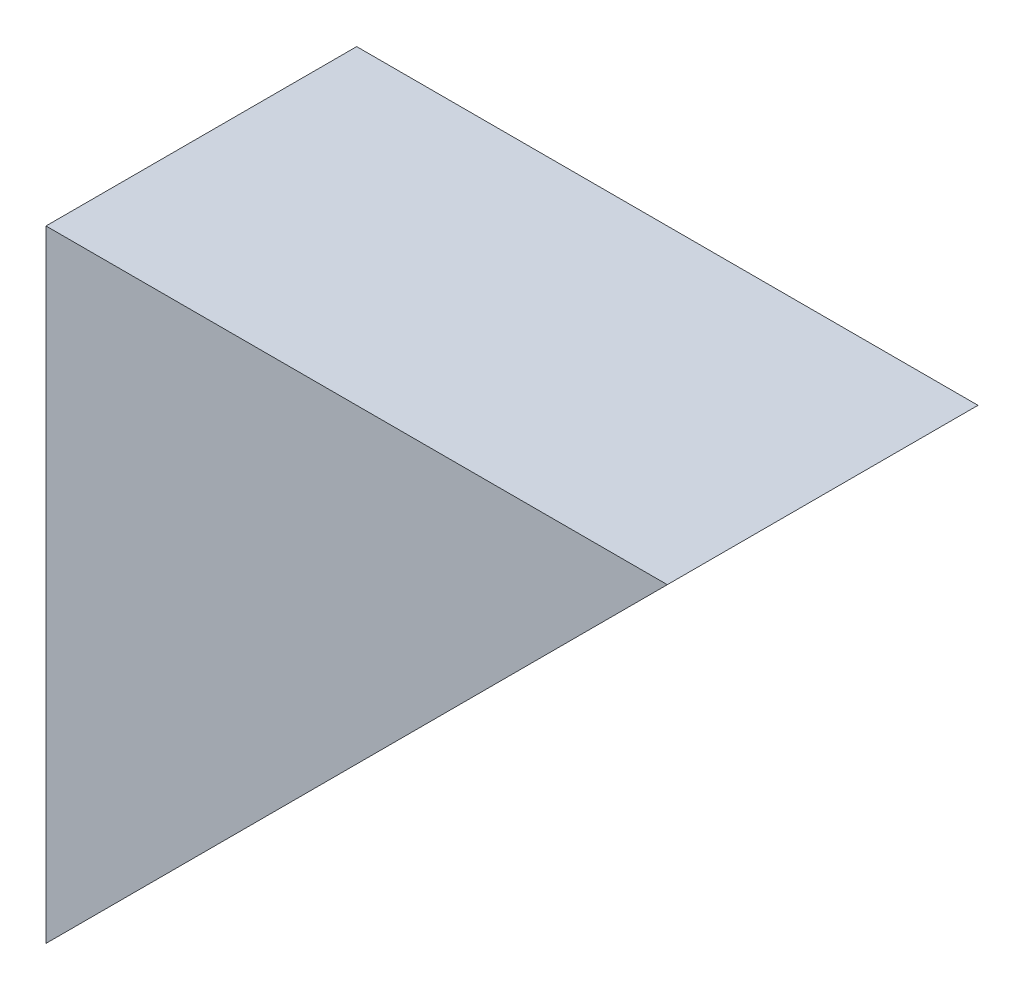
ISO-10303-21;
HEADER;
FILE_DESCRIPTION(('STEP AP214'),'2;1');
FILE_NAME('part.step','',(''),(''),'','','');
FILE_SCHEMA(('AUTOMOTIVE_DESIGN { 1 0 10303 214 1 1 1 1 }'));
ENDSEC;
DATA;
#1=APPLICATION_CONTEXT('core data for automotive mechanical design processes');
#2=APPLICATION_PROTOCOL_DEFINITION('international standard','automotive_design',2000,#1);
#3=PRODUCT_CONTEXT('',#1,'mechanical');
#4=PRODUCT('Part','Part','',(#3));
#5=PRODUCT_RELATED_PRODUCT_CATEGORY('part','',(#4));
#6=PRODUCT_DEFINITION_FORMATION('','',#4);
#7=PRODUCT_DEFINITION_CONTEXT('part definition',#1,'design');
#8=PRODUCT_DEFINITION('design','',#6,#7);
#9=PRODUCT_DEFINITION_SHAPE('','',#8);
#10=(LENGTH_UNIT() NAMED_UNIT(*) SI_UNIT(.MILLI.,.METRE.));
#11=(NAMED_UNIT(*) PLANE_ANGLE_UNIT() SI_UNIT($,.RADIAN.));
#12=(NAMED_UNIT(*) SI_UNIT($,.STERADIAN.) SOLID_ANGLE_UNIT());
#13=UNCERTAINTY_MEASURE_WITH_UNIT(LENGTH_MEASURE(1.E-05),#10,'distance_accuracy_value','');
#14=(GEOMETRIC_REPRESENTATION_CONTEXT(3) GLOBAL_UNCERTAINTY_ASSIGNED_CONTEXT((#13)) GLOBAL_UNIT_ASSIGNED_CONTEXT((#10,
#11,#12)) REPRESENTATION_CONTEXT('',''));
#15=CARTESIAN_POINT('',(0.,0.,0.));
#16=DIRECTION('',(0.,0.,1.));
#17=DIRECTION('',(1.,0.,0.));
#18=AXIS2_PLACEMENT_3D('',#15,#16,#17);
#19=CARTESIAN_POINT('',(-108.204482014186,92.0763617510564,-12.7));
#20=DIRECTION('',(0.,1.,0.));
#21=DIRECTION('',(0.,0.,1.));
#22=AXIS2_PLACEMENT_3D('',#19,#20,#21);
#23=PLANE('',#22);
#24=DIRECTION('',(-1.,0.,0.));
#25=VECTOR('',#24,1.);
#26=CARTESIAN_POINT('',(-108.204482014186,92.0763617510564,0.));
#27=LINE('',#26,#25);
#28=CARTESIAN_POINT('',(-82.8044820141863,92.0763617510564,0.));
#29=VERTEX_POINT('',#28);
#30=CARTESIAN_POINT('',(-108.204482014186,92.0763617510564,0.));
#31=VERTEX_POINT('',#30);
#32=EDGE_CURVE('E120',#29,#31,#27,.T.);
#33=ORIENTED_EDGE('',*,*,#32,.F.);
#34=DIRECTION('',(0.,0.,1.));
#35=VECTOR('',#34,1.);
#36=CARTESIAN_POINT('',(-82.8044820141863,92.0763617510564,-12.7));
#37=LINE('',#36,#35);
#38=CARTESIAN_POINT('',(-82.8044820141863,92.0763617510564,-12.7));
#39=VERTEX_POINT('',#38);
#40=EDGE_CURVE('E51',#39,#29,#37,.T.);
#41=ORIENTED_EDGE('',*,*,#40,.F.);
#42=DIRECTION('',(-1.,0.,0.));
#43=VECTOR('',#42,1.);
#44=CARTESIAN_POINT('',(-108.204482014186,92.0763617510564,-12.7));
#45=LINE('',#44,#43);
#46=CARTESIAN_POINT('',(-108.204482014186,92.0763617510564,-12.7));
#47=VERTEX_POINT('',#46);
#48=EDGE_CURVE('E113',#39,#47,#45,.T.);
#49=ORIENTED_EDGE('',*,*,#48,.T.);
#50=DIRECTION('',(0.,0.,1.));
#51=VECTOR('',#50,1.);
#52=CARTESIAN_POINT('',(-108.204482014186,92.0763617510564,-12.7));
#53=LINE('',#52,#51);
#54=EDGE_CURVE('E85',#47,#31,#53,.T.);
#55=ORIENTED_EDGE('',*,*,#54,.T.);
#56=EDGE_LOOP('',(#33,#41,#49,#55));
#57=FACE_BOUND('',#56,.T.);
#58=ADVANCED_FACE('F43',(#57),#23,.T.);
#59=CARTESIAN_POINT('',(-108.204482014186,66.6763617510564,-12.7));
#60=DIRECTION('',(0.707106781186548,-0.707106781186548,0.));
#61=DIRECTION('',(0.707106781186548,0.707106781186548,0.));
#62=AXIS2_PLACEMENT_3D('',#59,#60,#61);
#63=PLANE('',#62);
#64=CARTESIAN_POINT('',(-95.5044820141863,79.3763617510564,-6.34999999999999));
#65=DIRECTION('',(0.707106781186548,-0.707106781186548,0.));
#66=DIRECTION('',(-0.707106781186548,-0.707106781186548,0.));
#67=AXIS2_PLACEMENT_3D('',#64,#65,#66);
#68=ELLIPSE('',#67,6.36396103067892,4.49999999999999);
#69=CARTESIAN_POINT('',(-99.3144820141863,75.5663617510564,-8.74455632633686));
#70=VERTEX_POINT('',#69);
#71=CARTESIAN_POINT('',(-99.3144820141863,75.5663617510564,-3.95544367366313));
#72=VERTEX_POINT('',#71);
#73=EDGE_CURVE('E11',#70,#72,#68,.T.);
#74=ORIENTED_EDGE('',*,*,#73,.F.);
#75=DIRECTION('',(0.,0.,-1.));
#76=VECTOR('',#75,1.);
#77=CARTESIAN_POINT('',(-99.3144820141863,75.5663617510564,-12.7));
#78=LINE('',#77,#76);
#79=EDGE_CURVE('E89',#72,#70,#78,.T.);
#80=ORIENTED_EDGE('',*,*,#79,.F.);
#81=EDGE_LOOP('',(#74,#80));
#82=FACE_BOUND('',#81,.T.);
#83=DIRECTION('',(0.707106781186547,0.707106781186547,0.));
#84=VECTOR('',#83,1.);
#85=CARTESIAN_POINT('',(-108.204482014186,66.6763617510564,0.));
#86=LINE('',#85,#84);
#87=CARTESIAN_POINT('',(-108.204482014186,66.6763617510564,0.));
#88=VERTEX_POINT('',#87);
#89=EDGE_CURVE('E107',#88,#29,#86,.T.);
#90=ORIENTED_EDGE('',*,*,#89,.F.);
#91=DIRECTION('',(0.,0.,1.));
#92=VECTOR('',#91,1.);
#93=CARTESIAN_POINT('',(-108.204482014186,66.6763617510564,-12.7));
#94=LINE('',#93,#92);
#95=CARTESIAN_POINT('',(-108.204482014186,66.6763617510564,-12.7));
#96=VERTEX_POINT('',#95);
#97=EDGE_CURVE('E108',#96,#88,#94,.T.);
#98=ORIENTED_EDGE('',*,*,#97,.F.);
#99=DIRECTION('',(0.707106781186547,0.707106781186547,0.));
#100=VECTOR('',#99,1.);
#101=CARTESIAN_POINT('',(-108.204482014186,66.6763617510564,-12.7));
#102=LINE('',#101,#100);
#103=EDGE_CURVE('E129',#96,#39,#102,.T.);
#104=ORIENTED_EDGE('',*,*,#103,.T.);
#105=ORIENTED_EDGE('',*,*,#40,.T.);
#106=EDGE_LOOP('',(#90,#98,#104,#105));
#107=FACE_BOUND('',#106,.T.);
#108=ADVANCED_FACE('F102',(#82,#107),#63,.T.);
#109=CARTESIAN_POINT('',(-108.204482014186,92.0763617510564,-12.7));
#110=DIRECTION('',(-1.,0.,0.));
#111=DIRECTION('',(0.,0.,1.));
#112=AXIS2_PLACEMENT_3D('',#109,#110,#111);
#113=PLANE('',#112);
#114=CARTESIAN_POINT('',(-108.204482014186,79.3763617510564,-6.35));
#115=DIRECTION('',(-1.,0.,0.));
#116=DIRECTION('',(0.,0.,1.));
#117=AXIS2_PLACEMENT_3D('',#114,#115,#116);
#118=CIRCLE('',#117,2.25000000000001);
#119=CARTESIAN_POINT('',(-108.204482014186,79.3763617510564,-4.09999999999999));
#120=VERTEX_POINT('',#119);
#121=EDGE_CURVE('E95',#120,#120,#118,.T.);
#122=ORIENTED_EDGE('',*,*,#121,.F.);
#123=EDGE_LOOP('',(#122));
#124=FACE_BOUND('',#123,.T.);
#125=DIRECTION('',(0.,-1.,0.));
#126=VECTOR('',#125,1.);
#127=CARTESIAN_POINT('',(-108.204482014186,92.0763617510564,0.));
#128=LINE('',#127,#126);
#129=EDGE_CURVE('E114',#31,#88,#128,.T.);
#130=ORIENTED_EDGE('',*,*,#129,.F.);
#131=ORIENTED_EDGE('',*,*,#54,.F.);
#132=DIRECTION('',(0.,-1.,0.));
#133=VECTOR('',#132,1.);
#134=CARTESIAN_POINT('',(-108.204482014186,92.0763617510564,-12.7));
#135=LINE('',#134,#133);
#136=EDGE_CURVE('E118',#47,#96,#135,.T.);
#137=ORIENTED_EDGE('',*,*,#136,.T.);
#138=ORIENTED_EDGE('',*,*,#97,.T.);
#139=EDGE_LOOP('',(#130,#131,#137,#138));
#140=FACE_BOUND('',#139,.T.);
#141=ADVANCED_FACE('F104',(#124,#140),#113,.T.);
#142=CARTESIAN_POINT('',(0.,0.,-12.7));
#143=DIRECTION('',(0.,0.,-1.));
#144=DIRECTION('',(-1.,0.,0.));
#145=AXIS2_PLACEMENT_3D('',#142,#143,#144);
#146=PLANE('',#145);
#147=ORIENTED_EDGE('',*,*,#48,.F.);
#148=ORIENTED_EDGE('',*,*,#103,.F.);
#149=ORIENTED_EDGE('',*,*,#136,.F.);
#150=EDGE_LOOP('',(#147,#148,#149));
#151=FACE_BOUND('',#150,.T.);
#152=ADVANCED_FACE('F158',(#151),#146,.T.);
#153=CARTESIAN_POINT('',(0.,0.,0.));
#154=DIRECTION('',(0.,0.,-1.));
#155=DIRECTION('',(-1.,0.,0.));
#156=AXIS2_PLACEMENT_3D('',#153,#154,#155);
#157=PLANE('',#156);
#158=ORIENTED_EDGE('',*,*,#32,.T.);
#159=ORIENTED_EDGE('',*,*,#129,.T.);
#160=ORIENTED_EDGE('',*,*,#89,.T.);
#161=EDGE_LOOP('',(#158,#159,#160));
#162=FACE_BOUND('',#161,.T.);
#163=ADVANCED_FACE('F143',(#162),#157,.F.);
#164=CARTESIAN_POINT('',(-82.8044820141863,79.3763617510564,-6.35));
#165=DIRECTION('',(-1.,0.,0.));
#166=DIRECTION('',(0.,0.,1.));
#167=AXIS2_PLACEMENT_3D('',#164,#165,#166);
#168=CYLINDRICAL_SURFACE('',#167,2.25000000000001);
#169=CARTESIAN_POINT('',(-99.3144820141863,79.3763617510564,-6.35));
#170=DIRECTION('',(-1.,0.,0.));
#171=DIRECTION('',(0.,0.,1.));
#172=AXIS2_PLACEMENT_3D('',#169,#170,#171);
#173=CIRCLE('',#172,2.25000000000001);
#174=CARTESIAN_POINT('',(-99.3144820141863,79.3763617510564,-4.09999999999999));
#175=VERTEX_POINT('',#174);
#176=EDGE_CURVE('E96',#175,#175,#173,.F.);
#177=ORIENTED_EDGE('',*,*,#176,.T.);
#178=EDGE_LOOP('',(#177));
#179=FACE_BOUND('',#178,.T.);
#180=ORIENTED_EDGE('',*,*,#121,.T.);
#181=EDGE_LOOP('',(#180));
#182=FACE_BOUND('',#181,.T.);
#183=ADVANCED_FACE('F134',(#179,#182),#168,.F.);
#184=CARTESIAN_POINT('',(-99.3144820141863,79.3763617510564,-6.34999999999999));
#185=DIRECTION('',(-1.,0.,0.));
#186=DIRECTION('',(0.,0.,1.));
#187=AXIS2_PLACEMENT_3D('',#184,#185,#186);
#188=PLANE('',#187);
#189=ORIENTED_EDGE('',*,*,#79,.T.);
#190=CARTESIAN_POINT('',(-99.3144820141863,79.3763617510564,-6.34999999999999));
#191=DIRECTION('',(-1.,0.,0.));
#192=DIRECTION('',(0.,0.,1.));
#193=AXIS2_PLACEMENT_3D('',#190,#191,#192);
#194=CIRCLE('',#193,4.49999999999999);
#195=EDGE_CURVE('E57',#72,#70,#194,.T.);
#196=ORIENTED_EDGE('',*,*,#195,.F.);
#197=EDGE_LOOP('',(#189,#196));
#198=FACE_BOUND('',#197,.T.);
#199=ORIENTED_EDGE('',*,*,#176,.F.);
#200=EDGE_LOOP('',(#199));
#201=FACE_BOUND('',#200,.T.);
#202=ADVANCED_FACE('F90',(#198,#201),#188,.F.);
#203=CARTESIAN_POINT('',(-82.8044820141863,79.3763617510564,-6.34999999999999));
#204=DIRECTION('',(-1.,0.,0.));
#205=DIRECTION('',(0.,0.,1.));
#206=AXIS2_PLACEMENT_3D('',#203,#204,#205);
#207=CYLINDRICAL_SURFACE('',#206,4.49999999999999);
#208=ORIENTED_EDGE('',*,*,#73,.T.);
#209=ORIENTED_EDGE('',*,*,#195,.T.);
#210=EDGE_LOOP('',(#208,#209));
#211=FACE_BOUND('',#210,.T.);
#212=ADVANCED_FACE('F99',(#211),#207,.F.);
#213=CLOSED_SHELL('',(#58,#108,#141,#152,#163,#183,#202,#212));
#214=MANIFOLD_SOLID_BREP('B2',#213);
#215=ADVANCED_BREP_SHAPE_REPRESENTATION('',(#18,#214),#14);
#216=SHAPE_DEFINITION_REPRESENTATION(#9,#215);
ENDSEC;
END-ISO-10303-21;
